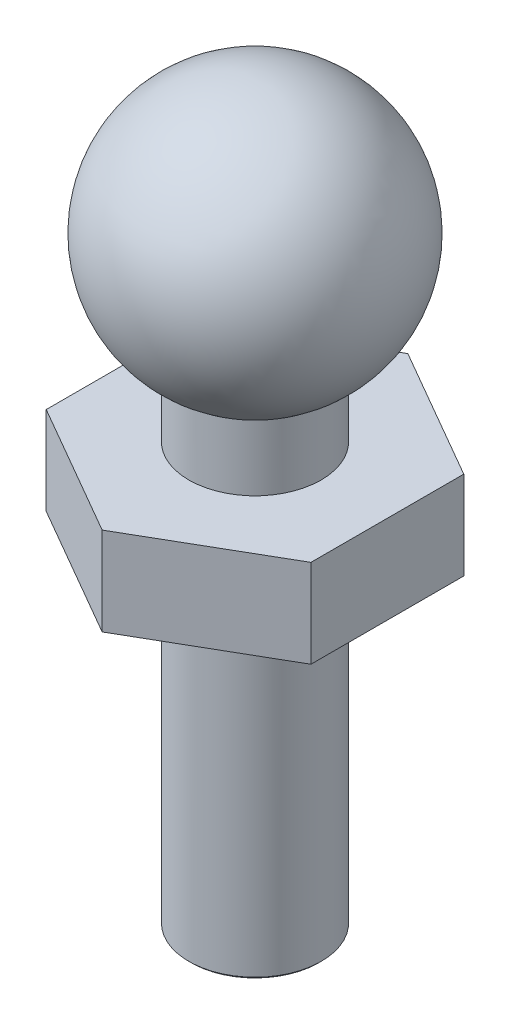
ISO-10303-21;
HEADER;
FILE_DESCRIPTION(('STEP AP214'),'2;1');
FILE_NAME('part.step','',(''),(''),'','','');
FILE_SCHEMA(('AUTOMOTIVE_DESIGN { 1 0 10303 214 1 1 1 1 }'));
ENDSEC;
DATA;
#1=APPLICATION_CONTEXT('core data for automotive mechanical design processes');
#2=APPLICATION_PROTOCOL_DEFINITION('international standard','automotive_design',2000,#1);
#3=PRODUCT_CONTEXT('',#1,'mechanical');
#4=PRODUCT('Part','Part','',(#3));
#5=PRODUCT_RELATED_PRODUCT_CATEGORY('part','',(#4));
#6=PRODUCT_DEFINITION_FORMATION('','',#4);
#7=PRODUCT_DEFINITION_CONTEXT('part definition',#1,'design');
#8=PRODUCT_DEFINITION('design','',#6,#7);
#9=PRODUCT_DEFINITION_SHAPE('','',#8);
#10=(LENGTH_UNIT() NAMED_UNIT(*) SI_UNIT(.MILLI.,.METRE.));
#11=(NAMED_UNIT(*) PLANE_ANGLE_UNIT() SI_UNIT($,.RADIAN.));
#12=(NAMED_UNIT(*) SI_UNIT($,.STERADIAN.) SOLID_ANGLE_UNIT());
#13=UNCERTAINTY_MEASURE_WITH_UNIT(LENGTH_MEASURE(1.E-05),#10,'distance_accuracy_value','');
#14=(GEOMETRIC_REPRESENTATION_CONTEXT(3) GLOBAL_UNCERTAINTY_ASSIGNED_CONTEXT((#13)) GLOBAL_UNIT_ASSIGNED_CONTEXT((#10,
#11,#12)) REPRESENTATION_CONTEXT('',''));
#15=CARTESIAN_POINT('',(0.,0.,0.));
#16=DIRECTION('',(0.,0.,1.));
#17=DIRECTION('',(1.,0.,0.));
#18=AXIS2_PLACEMENT_3D('',#15,#16,#17);
#19=CARTESIAN_POINT('',(0.,0.,0.));
#20=DIRECTION('',(0.,-1.,0.));
#21=DIRECTION('',(0.,0.,-1.));
#22=AXIS2_PLACEMENT_3D('',#19,#20,#21);
#23=CYLINDRICAL_SURFACE('',#22,1.5);
#24=CARTESIAN_POINT('',(0.,0.0500000000000012,0.));
#25=DIRECTION('',(0.,-1.,0.));
#26=DIRECTION('',(0.,0.,-1.));
#27=AXIS2_PLACEMENT_3D('',#24,#25,#26);
#28=CIRCLE('',#27,1.5);
#29=CARTESIAN_POINT('',(0.,0.0500000000000012,-1.5));
#30=VERTEX_POINT('',#29);
#31=EDGE_CURVE('E45',#30,#30,#28,.F.);
#32=ORIENTED_EDGE('',*,*,#31,.T.);
#33=EDGE_LOOP('',(#32));
#34=FACE_BOUND('',#33,.T.);
#35=CARTESIAN_POINT('',(0.,7.5,0.));
#36=DIRECTION('',(0.,1.,0.));
#37=DIRECTION('',(0.,0.,1.));
#38=AXIS2_PLACEMENT_3D('',#35,#36,#37);
#39=CIRCLE('',#38,1.5);
#40=CARTESIAN_POINT('',(0.,7.5,1.5));
#41=VERTEX_POINT('',#40);
#42=EDGE_CURVE('E127',#41,#41,#39,.T.);
#43=ORIENTED_EDGE('',*,*,#42,.F.);
#44=EDGE_LOOP('',(#43));
#45=FACE_BOUND('',#44,.T.);
#46=ADVANCED_FACE('F36',(#34,#45),#23,.T.);
#47=CARTESIAN_POINT('',(0.,0.,0.));
#48=DIRECTION('',(0.,-1.,0.));
#49=DIRECTION('',(0.,0.,-1.));
#50=AXIS2_PLACEMENT_3D('',#47,#48,#49);
#51=PLANE('',#50);
#52=CARTESIAN_POINT('',(0.,0.,0.));
#53=DIRECTION('',(0.,-1.,0.));
#54=DIRECTION('',(0.,0.,-1.));
#55=AXIS2_PLACEMENT_3D('',#52,#53,#54);
#56=CIRCLE('',#55,1.45);
#57=CARTESIAN_POINT('',(0.,0.,-1.45));
#58=VERTEX_POINT('',#57);
#59=EDGE_CURVE('E146',#58,#58,#56,.T.);
#60=ORIENTED_EDGE('',*,*,#59,.T.);
#61=EDGE_LOOP('',(#60));
#62=FACE_BOUND('',#61,.T.);
#63=ADVANCED_FACE('F155',(#62),#51,.T.);
#64=CARTESIAN_POINT('',(0.,0.,0.));
#65=DIRECTION('',(0.,1.,0.));
#66=DIRECTION('',(0.,0.,1.));
#67=AXIS2_PLACEMENT_3D('',#64,#65,#66);
#68=CONICAL_SURFACE('',#67,1.45,0.785398163397438);
#69=ORIENTED_EDGE('',*,*,#31,.F.);
#70=EDGE_LOOP('',(#69));
#71=FACE_BOUND('',#70,.T.);
#72=ORIENTED_EDGE('',*,*,#59,.F.);
#73=EDGE_LOOP('',(#72));
#74=FACE_BOUND('',#73,.T.);
#75=ADVANCED_FACE('F38',(#71,#74),#68,.T.);
#76=CARTESIAN_POINT('',(0.,9.5,0.));
#77=DIRECTION('',(0.,1.,0.));
#78=DIRECTION('',(0.,0.,1.));
#79=AXIS2_PLACEMENT_3D('',#76,#77,#78);
#80=PLANE('',#79);
#81=DIRECTION('',(0.,0.,-1.));
#82=VECTOR('',#81,1.);
#83=CARTESIAN_POINT('',(3.,9.5,1.73205080756886));
#84=LINE('',#83,#82);
#85=CARTESIAN_POINT('',(3.,9.5,1.73205080756886));
#86=VERTEX_POINT('',#85);
#87=CARTESIAN_POINT('',(2.99999999999999,9.5,-1.73205080756889));
#88=VERTEX_POINT('',#87);
#89=EDGE_CURVE('E134',#86,#88,#84,.T.);
#90=ORIENTED_EDGE('',*,*,#89,.T.);
#91=DIRECTION('',(-0.86602540378444,0.,-0.499999999999997));
#92=VECTOR('',#91,1.);
#93=CARTESIAN_POINT('',(2.99999999999999,9.5,-1.73205080756889));
#94=LINE('',#93,#92);
#95=CARTESIAN_POINT('',(0.,9.5,-3.46410161513775));
#96=VERTEX_POINT('',#95);
#97=EDGE_CURVE('E91',#88,#96,#94,.T.);
#98=ORIENTED_EDGE('',*,*,#97,.T.);
#99=DIRECTION('',(-0.866025403784437,0.,0.500000000000003));
#100=VECTOR('',#99,1.);
#101=CARTESIAN_POINT('',(0.,9.5,-3.46410161513775));
#102=LINE('',#101,#100);
#103=CARTESIAN_POINT('',(-3.,9.5,-1.73205080756887));
#104=VERTEX_POINT('',#103);
#105=EDGE_CURVE('E105',#96,#104,#102,.T.);
#106=ORIENTED_EDGE('',*,*,#105,.T.);
#107=DIRECTION('',(0.,0.,1.));
#108=VECTOR('',#107,1.);
#109=CARTESIAN_POINT('',(-3.,9.5,-1.73205080756887));
#110=LINE('',#109,#108);
#111=CARTESIAN_POINT('',(-2.99999999999999,9.5,1.73205080756889));
#112=VERTEX_POINT('',#111);
#113=EDGE_CURVE('E98',#104,#112,#110,.T.);
#114=ORIENTED_EDGE('',*,*,#113,.T.);
#115=DIRECTION('',(0.866025403784439,0.,0.5));
#116=VECTOR('',#115,1.);
#117=CARTESIAN_POINT('',(-2.99999999999999,9.5,1.73205080756889));
#118=LINE('',#117,#116);
#119=CARTESIAN_POINT('',(0.,9.5,3.46410161513776));
#120=VERTEX_POINT('',#119);
#121=EDGE_CURVE('E103',#112,#120,#118,.T.);
#122=ORIENTED_EDGE('',*,*,#121,.T.);
#123=DIRECTION('',(0.866025403784436,0.,-0.500000000000005));
#124=VECTOR('',#123,1.);
#125=CARTESIAN_POINT('',(0.,9.5,3.46410161513776));
#126=LINE('',#125,#124);
#127=EDGE_CURVE('E53',#120,#86,#126,.T.);
#128=ORIENTED_EDGE('',*,*,#127,.T.);
#129=EDGE_LOOP('',(#90,#98,#106,#114,#122,#128));
#130=FACE_BOUND('',#129,.T.);
#131=CARTESIAN_POINT('',(0.,9.5,0.));
#132=DIRECTION('',(0.,1.,0.));
#133=DIRECTION('',(0.,0.,1.));
#134=AXIS2_PLACEMENT_3D('',#131,#132,#133);
#135=CIRCLE('',#134,1.5);
#136=CARTESIAN_POINT('',(0.,9.5,1.5));
#137=VERTEX_POINT('',#136);
#138=EDGE_CURVE('E11',#137,#137,#135,.F.);
#139=ORIENTED_EDGE('',*,*,#138,.T.);
#140=EDGE_LOOP('',(#139));
#141=FACE_BOUND('',#140,.T.);
#142=ADVANCED_FACE('F100',(#130,#141),#80,.T.);
#143=CARTESIAN_POINT('',(0.,7.5,0.));
#144=DIRECTION('',(0.,1.,0.));
#145=DIRECTION('',(0.,0.,1.));
#146=AXIS2_PLACEMENT_3D('',#143,#144,#145);
#147=PLANE('',#146);
#148=DIRECTION('',(0.,0.,-1.));
#149=VECTOR('',#148,1.);
#150=CARTESIAN_POINT('',(3.,7.5,1.73205080756886));
#151=LINE('',#150,#149);
#152=CARTESIAN_POINT('',(3.,7.5,1.73205080756886));
#153=VERTEX_POINT('',#152);
#154=CARTESIAN_POINT('',(2.99999999999999,7.5,-1.73205080756889));
#155=VERTEX_POINT('',#154);
#156=EDGE_CURVE('E123',#153,#155,#151,.T.);
#157=ORIENTED_EDGE('',*,*,#156,.F.);
#158=DIRECTION('',(0.866025403784436,0.,-0.500000000000005));
#159=VECTOR('',#158,1.);
#160=CARTESIAN_POINT('',(0.,7.5,3.46410161513776));
#161=LINE('',#160,#159);
#162=CARTESIAN_POINT('',(0.,7.5,3.46410161513776));
#163=VERTEX_POINT('',#162);
#164=EDGE_CURVE('E82',#163,#153,#161,.T.);
#165=ORIENTED_EDGE('',*,*,#164,.F.);
#166=DIRECTION('',(0.866025403784439,0.,0.5));
#167=VECTOR('',#166,1.);
#168=CARTESIAN_POINT('',(-2.99999999999999,7.5,1.73205080756889));
#169=LINE('',#168,#167);
#170=CARTESIAN_POINT('',(-2.99999999999999,7.5,1.73205080756889));
#171=VERTEX_POINT('',#170);
#172=EDGE_CURVE('E76',#171,#163,#169,.T.);
#173=ORIENTED_EDGE('',*,*,#172,.F.);
#174=DIRECTION('',(0.,0.,1.));
#175=VECTOR('',#174,1.);
#176=CARTESIAN_POINT('',(-3.,7.5,-1.73205080756887));
#177=LINE('',#176,#175);
#178=CARTESIAN_POINT('',(-3.,7.5,-1.73205080756887));
#179=VERTEX_POINT('',#178);
#180=EDGE_CURVE('E113',#179,#171,#177,.T.);
#181=ORIENTED_EDGE('',*,*,#180,.F.);
#182=DIRECTION('',(-0.866025403784437,0.,0.500000000000003));
#183=VECTOR('',#182,1.);
#184=CARTESIAN_POINT('',(0.,7.5,-3.46410161513775));
#185=LINE('',#184,#183);
#186=CARTESIAN_POINT('',(0.,7.5,-3.46410161513775));
#187=VERTEX_POINT('',#186);
#188=EDGE_CURVE('E129',#187,#179,#185,.T.);
#189=ORIENTED_EDGE('',*,*,#188,.F.);
#190=DIRECTION('',(-0.86602540378444,0.,-0.499999999999997));
#191=VECTOR('',#190,1.);
#192=CARTESIAN_POINT('',(2.99999999999999,7.5,-1.73205080756889));
#193=LINE('',#192,#191);
#194=EDGE_CURVE('E126',#155,#187,#193,.T.);
#195=ORIENTED_EDGE('',*,*,#194,.F.);
#196=EDGE_LOOP('',(#157,#165,#173,#181,#189,#195));
#197=FACE_BOUND('',#196,.T.);
#198=ORIENTED_EDGE('',*,*,#42,.T.);
#199=EDGE_LOOP('',(#198));
#200=FACE_BOUND('',#199,.T.);
#201=ADVANCED_FACE('F185',(#197,#200),#147,.F.);
#202=CARTESIAN_POINT('',(3.,9.5,1.73205080756886));
#203=DIRECTION('',(-1.,0.,0.));
#204=DIRECTION('',(0.,0.,1.));
#205=AXIS2_PLACEMENT_3D('',#202,#203,#204);
#206=PLANE('',#205);
#207=ORIENTED_EDGE('',*,*,#156,.T.);
#208=DIRECTION('',(0.,-1.,0.));
#209=VECTOR('',#208,1.);
#210=CARTESIAN_POINT('',(2.99999999999999,9.5,-1.73205080756889));
#211=LINE('',#210,#209);
#212=EDGE_CURVE('E141',#88,#155,#211,.T.);
#213=ORIENTED_EDGE('',*,*,#212,.F.);
#214=ORIENTED_EDGE('',*,*,#89,.F.);
#215=DIRECTION('',(0.,-1.,0.));
#216=VECTOR('',#215,1.);
#217=CARTESIAN_POINT('',(3.,9.5,1.73205080756886));
#218=LINE('',#217,#216);
#219=EDGE_CURVE('E119',#86,#153,#218,.T.);
#220=ORIENTED_EDGE('',*,*,#219,.T.);
#221=EDGE_LOOP('',(#207,#213,#214,#220));
#222=FACE_BOUND('',#221,.T.);
#223=ADVANCED_FACE('F166',(#222),#206,.F.);
#224=CARTESIAN_POINT('',(2.99999999999999,9.5,-1.73205080756889));
#225=DIRECTION('',(-0.499999999999997,0.,0.86602540378444));
#226=DIRECTION('',(0.86602540378444,0.,0.499999999999997));
#227=AXIS2_PLACEMENT_3D('',#224,#225,#226);
#228=PLANE('',#227);
#229=ORIENTED_EDGE('',*,*,#194,.T.);
#230=DIRECTION('',(0.,-1.,0.));
#231=VECTOR('',#230,1.);
#232=CARTESIAN_POINT('',(0.,9.5,-3.46410161513775));
#233=LINE('',#232,#231);
#234=EDGE_CURVE('E138',#96,#187,#233,.T.);
#235=ORIENTED_EDGE('',*,*,#234,.F.);
#236=ORIENTED_EDGE('',*,*,#97,.F.);
#237=ORIENTED_EDGE('',*,*,#212,.T.);
#238=EDGE_LOOP('',(#229,#235,#236,#237));
#239=FACE_BOUND('',#238,.T.);
#240=ADVANCED_FACE('F192',(#239),#228,.F.);
#241=CARTESIAN_POINT('',(0.,9.5,-3.46410161513775));
#242=DIRECTION('',(0.500000000000003,0.,0.866025403784437));
#243=DIRECTION('',(0.866025403784437,0.,-0.500000000000003));
#244=AXIS2_PLACEMENT_3D('',#241,#242,#243);
#245=PLANE('',#244);
#246=ORIENTED_EDGE('',*,*,#188,.T.);
#247=DIRECTION('',(0.,-1.,0.));
#248=VECTOR('',#247,1.);
#249=CARTESIAN_POINT('',(-3.,9.5,-1.73205080756887));
#250=LINE('',#249,#248);
#251=EDGE_CURVE('E114',#104,#179,#250,.T.);
#252=ORIENTED_EDGE('',*,*,#251,.F.);
#253=ORIENTED_EDGE('',*,*,#105,.F.);
#254=ORIENTED_EDGE('',*,*,#234,.T.);
#255=EDGE_LOOP('',(#246,#252,#253,#254));
#256=FACE_BOUND('',#255,.T.);
#257=ADVANCED_FACE('F190',(#256),#245,.F.);
#258=CARTESIAN_POINT('',(-3.,9.5,-1.73205080756887));
#259=DIRECTION('',(1.,0.,0.));
#260=DIRECTION('',(0.,0.,-1.));
#261=AXIS2_PLACEMENT_3D('',#258,#259,#260);
#262=PLANE('',#261);
#263=ORIENTED_EDGE('',*,*,#180,.T.);
#264=DIRECTION('',(0.,-1.,0.));
#265=VECTOR('',#264,1.);
#266=CARTESIAN_POINT('',(-2.99999999999999,9.5,1.73205080756889));
#267=LINE('',#266,#265);
#268=EDGE_CURVE('E110',#112,#171,#267,.T.);
#269=ORIENTED_EDGE('',*,*,#268,.F.);
#270=ORIENTED_EDGE('',*,*,#113,.F.);
#271=ORIENTED_EDGE('',*,*,#251,.T.);
#272=EDGE_LOOP('',(#263,#269,#270,#271));
#273=FACE_BOUND('',#272,.T.);
#274=ADVANCED_FACE('F111',(#273),#262,.F.);
#275=CARTESIAN_POINT('',(-2.99999999999999,9.5,1.73205080756889));
#276=DIRECTION('',(0.499999999999999,0.,-0.866025403784439));
#277=DIRECTION('',(-0.866025403784439,0.,-0.5));
#278=AXIS2_PLACEMENT_3D('',#275,#276,#277);
#279=PLANE('',#278);
#280=ORIENTED_EDGE('',*,*,#172,.T.);
#281=DIRECTION('',(0.,-1.,0.));
#282=VECTOR('',#281,1.);
#283=CARTESIAN_POINT('',(0.,9.5,3.46410161513776));
#284=LINE('',#283,#282);
#285=EDGE_CURVE('E115',#120,#163,#284,.T.);
#286=ORIENTED_EDGE('',*,*,#285,.F.);
#287=ORIENTED_EDGE('',*,*,#121,.F.);
#288=ORIENTED_EDGE('',*,*,#268,.T.);
#289=EDGE_LOOP('',(#280,#286,#287,#288));
#290=FACE_BOUND('',#289,.T.);
#291=ADVANCED_FACE('F117',(#290),#279,.F.);
#292=CARTESIAN_POINT('',(0.,9.5,3.46410161513776));
#293=DIRECTION('',(-0.500000000000005,0.,-0.866025403784436));
#294=DIRECTION('',(-0.866025403784436,0.,0.500000000000005));
#295=AXIS2_PLACEMENT_3D('',#292,#293,#294);
#296=PLANE('',#295);
#297=ORIENTED_EDGE('',*,*,#164,.T.);
#298=ORIENTED_EDGE('',*,*,#219,.F.);
#299=ORIENTED_EDGE('',*,*,#127,.F.);
#300=ORIENTED_EDGE('',*,*,#285,.T.);
#301=EDGE_LOOP('',(#297,#298,#299,#300));
#302=FACE_BOUND('',#301,.T.);
#303=ADVANCED_FACE('F172',(#302),#296,.F.);
#304=CARTESIAN_POINT('',(0.,13.5980762113533,0.));
#305=DIRECTION('',(0.,-1.,0.));
#306=DIRECTION('',(1.,0.,0.));
#307=AXIS2_PLACEMENT_3D('',#304,#305,#306);
#308=SPHERICAL_SURFACE('',#307,3.);
#309=CARTESIAN_POINT('',(0.,11.,0.));
#310=DIRECTION('',(0.,-1.,0.));
#311=DIRECTION('',(0.,0.,-1.));
#312=AXIS2_PLACEMENT_3D('',#309,#310,#311);
#313=CIRCLE('',#312,1.5);
#314=CARTESIAN_POINT('',(0.,11.,-1.5));
#315=VERTEX_POINT('',#314);
#316=EDGE_CURVE('E143',#315,#315,#313,.T.);
#317=ORIENTED_EDGE('',*,*,#316,.F.);
#318=EDGE_LOOP('',(#317));
#319=FACE_BOUND('',#318,.T.);
#320=ADVANCED_FACE('F169',(#319),#308,.T.);
#321=ORIENTED_EDGE('',*,*,#138,.F.);
#322=EDGE_LOOP('',(#321));
#323=FACE_BOUND('',#322,.T.);
#324=ORIENTED_EDGE('',*,*,#316,.T.);
#325=EDGE_LOOP('',(#324));
#326=FACE_BOUND('',#325,.T.);
#327=ADVANCED_FACE('F164',(#323,#326),#23,.T.);
#328=CLOSED_SHELL('',(#46,#63,#75,#142,#201,#223,#240,#257,#274,#291,#303,#320,#327));
#329=MANIFOLD_SOLID_BREP('B2',#328);
#330=ADVANCED_BREP_SHAPE_REPRESENTATION('',(#18,#329),#14);
#331=SHAPE_DEFINITION_REPRESENTATION(#9,#330);
ENDSEC;
END-ISO-10303-21;
